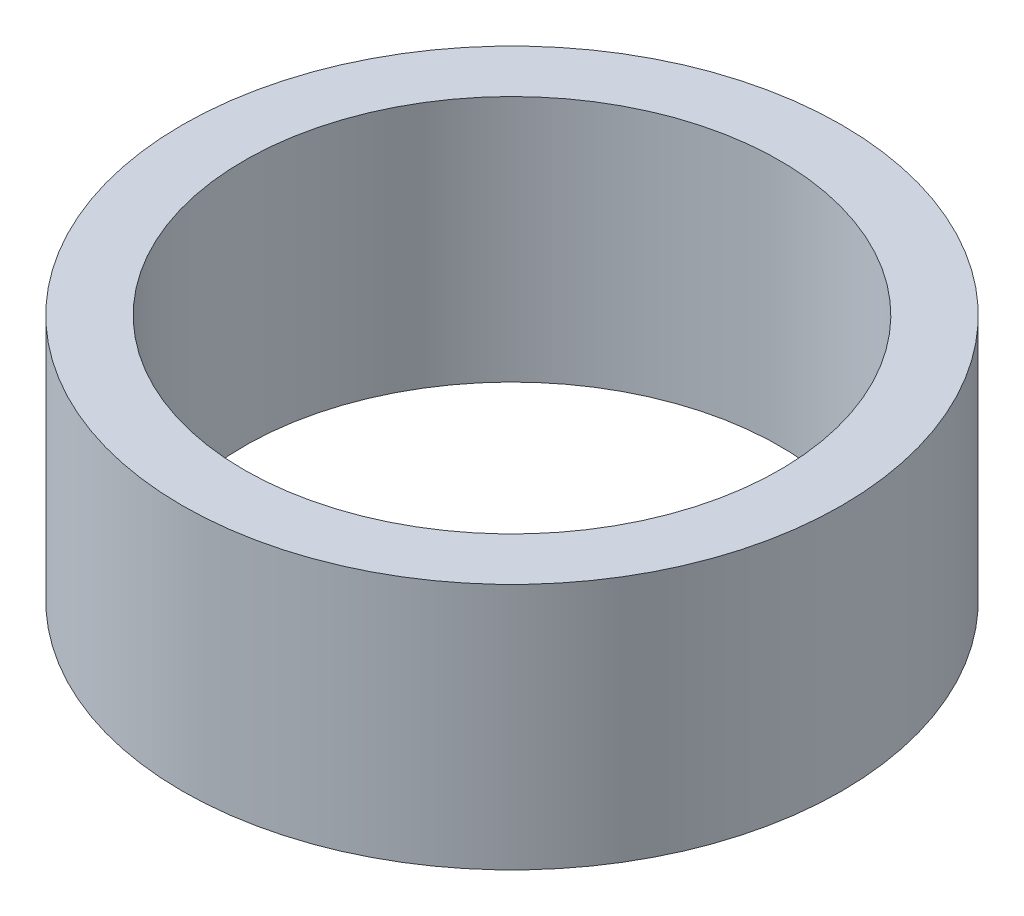
ISO-10303-21;
HEADER;
FILE_DESCRIPTION(('STEP AP214'),'2;1');
FILE_NAME('part.step','',(''),(''),'','','');
FILE_SCHEMA(('AUTOMOTIVE_DESIGN { 1 0 10303 214 1 1 1 1 }'));
ENDSEC;
DATA;
#1=APPLICATION_CONTEXT('core data for automotive mechanical design processes');
#2=APPLICATION_PROTOCOL_DEFINITION('international standard','automotive_design',2000,#1);
#3=PRODUCT_CONTEXT('',#1,'mechanical');
#4=PRODUCT('Part','Part','',(#3));
#5=PRODUCT_RELATED_PRODUCT_CATEGORY('part','',(#4));
#6=PRODUCT_DEFINITION_FORMATION('','',#4);
#7=PRODUCT_DEFINITION_CONTEXT('part definition',#1,'design');
#8=PRODUCT_DEFINITION('design','',#6,#7);
#9=PRODUCT_DEFINITION_SHAPE('','',#8);
#10=(LENGTH_UNIT() NAMED_UNIT(*) SI_UNIT(.MILLI.,.METRE.));
#11=(NAMED_UNIT(*) PLANE_ANGLE_UNIT() SI_UNIT($,.RADIAN.));
#12=(NAMED_UNIT(*) SI_UNIT($,.STERADIAN.) SOLID_ANGLE_UNIT());
#13=UNCERTAINTY_MEASURE_WITH_UNIT(LENGTH_MEASURE(1.E-05),#10,'distance_accuracy_value','');
#14=(GEOMETRIC_REPRESENTATION_CONTEXT(3) GLOBAL_UNCERTAINTY_ASSIGNED_CONTEXT((#13)) GLOBAL_UNIT_ASSIGNED_CONTEXT((#10,
#11,#12)) REPRESENTATION_CONTEXT('',''));
#15=CARTESIAN_POINT('',(0.,0.,0.));
#16=DIRECTION('',(0.,0.,1.));
#17=DIRECTION('',(1.,0.,0.));
#18=AXIS2_PLACEMENT_3D('',#15,#16,#17);
#19=CARTESIAN_POINT('',(0.,30.,0.));
#20=DIRECTION('',(0.,-1.,0.));
#21=DIRECTION('',(0.,0.,-1.));
#22=AXIS2_PLACEMENT_3D('',#19,#20,#21);
#23=CYLINDRICAL_SURFACE('',#22,40.);
#24=CARTESIAN_POINT('',(0.,30.,0.));
#25=DIRECTION('',(0.,1.,0.));
#26=DIRECTION('',(0.,0.,1.));
#27=AXIS2_PLACEMENT_3D('',#24,#25,#26);
#28=CIRCLE('',#27,40.);
#29=CARTESIAN_POINT('',(0.,30.,40.));
#30=VERTEX_POINT('',#29);
#31=EDGE_CURVE('E10',#30,#30,#28,.T.);
#32=ORIENTED_EDGE('',*,*,#31,.F.);
#33=EDGE_LOOP('',(#32));
#34=FACE_BOUND('',#33,.T.);
#35=CARTESIAN_POINT('',(0.,0.,0.));
#36=DIRECTION('',(0.,1.,0.));
#37=DIRECTION('',(0.,0.,1.));
#38=AXIS2_PLACEMENT_3D('',#35,#36,#37);
#39=CIRCLE('',#38,40.);
#40=CARTESIAN_POINT('',(0.,0.,40.));
#41=VERTEX_POINT('',#40);
#42=EDGE_CURVE('E37',#41,#41,#39,.T.);
#43=ORIENTED_EDGE('',*,*,#42,.T.);
#44=EDGE_LOOP('',(#43));
#45=FACE_BOUND('',#44,.T.);
#46=ADVANCED_FACE('F40',(#34,#45),#23,.T.);
#47=CARTESIAN_POINT('',(0.,30.,0.));
#48=DIRECTION('',(0.,1.,0.));
#49=DIRECTION('',(0.,0.,1.));
#50=AXIS2_PLACEMENT_3D('',#47,#48,#49);
#51=PLANE('',#50);
#52=CARTESIAN_POINT('',(0.,30.,0.));
#53=DIRECTION('',(0.,1.,0.));
#54=DIRECTION('',(0.,0.,1.));
#55=AXIS2_PLACEMENT_3D('',#52,#53,#54);
#56=CIRCLE('',#55,32.5);
#57=CARTESIAN_POINT('',(0.,30.,32.5));
#58=VERTEX_POINT('',#57);
#59=EDGE_CURVE('E50',#58,#58,#56,.T.);
#60=ORIENTED_EDGE('',*,*,#59,.F.);
#61=EDGE_LOOP('',(#60));
#62=FACE_BOUND('',#61,.T.);
#63=ORIENTED_EDGE('',*,*,#31,.T.);
#64=EDGE_LOOP('',(#63));
#65=FACE_BOUND('',#64,.T.);
#66=ADVANCED_FACE('F59',(#62,#65),#51,.T.);
#67=CARTESIAN_POINT('',(0.,0.,0.));
#68=DIRECTION('',(0.,1.,0.));
#69=DIRECTION('',(0.,0.,1.));
#70=AXIS2_PLACEMENT_3D('',#67,#68,#69);
#71=PLANE('',#70);
#72=CARTESIAN_POINT('',(0.,0.,0.));
#73=DIRECTION('',(0.,1.,0.));
#74=DIRECTION('',(0.,0.,1.));
#75=AXIS2_PLACEMENT_3D('',#72,#73,#74);
#76=CIRCLE('',#75,32.5);
#77=CARTESIAN_POINT('',(0.,0.,32.5));
#78=VERTEX_POINT('',#77);
#79=EDGE_CURVE('E47',#78,#78,#76,.T.);
#80=ORIENTED_EDGE('',*,*,#79,.T.);
#81=EDGE_LOOP('',(#80));
#82=FACE_BOUND('',#81,.T.);
#83=ORIENTED_EDGE('',*,*,#42,.F.);
#84=EDGE_LOOP('',(#83));
#85=FACE_BOUND('',#84,.T.);
#86=ADVANCED_FACE('F58',(#82,#85),#71,.F.);
#87=CARTESIAN_POINT('',(0.,30.,0.));
#88=DIRECTION('',(0.,-1.,0.));
#89=DIRECTION('',(0.,0.,-1.));
#90=AXIS2_PLACEMENT_3D('',#87,#88,#89);
#91=CYLINDRICAL_SURFACE('',#90,32.5);
#92=ORIENTED_EDGE('',*,*,#59,.T.);
#93=EDGE_LOOP('',(#92));
#94=FACE_BOUND('',#93,.T.);
#95=ORIENTED_EDGE('',*,*,#79,.F.);
#96=EDGE_LOOP('',(#95));
#97=FACE_BOUND('',#96,.T.);
#98=ADVANCED_FACE('F54',(#94,#97),#91,.F.);
#99=CLOSED_SHELL('',(#46,#66,#86,#98));
#100=MANIFOLD_SOLID_BREP('B2',#99);
#101=ADVANCED_BREP_SHAPE_REPRESENTATION('',(#18,#100),#14);
#102=SHAPE_DEFINITION_REPRESENTATION(#9,#101);
ENDSEC;
END-ISO-10303-21;
